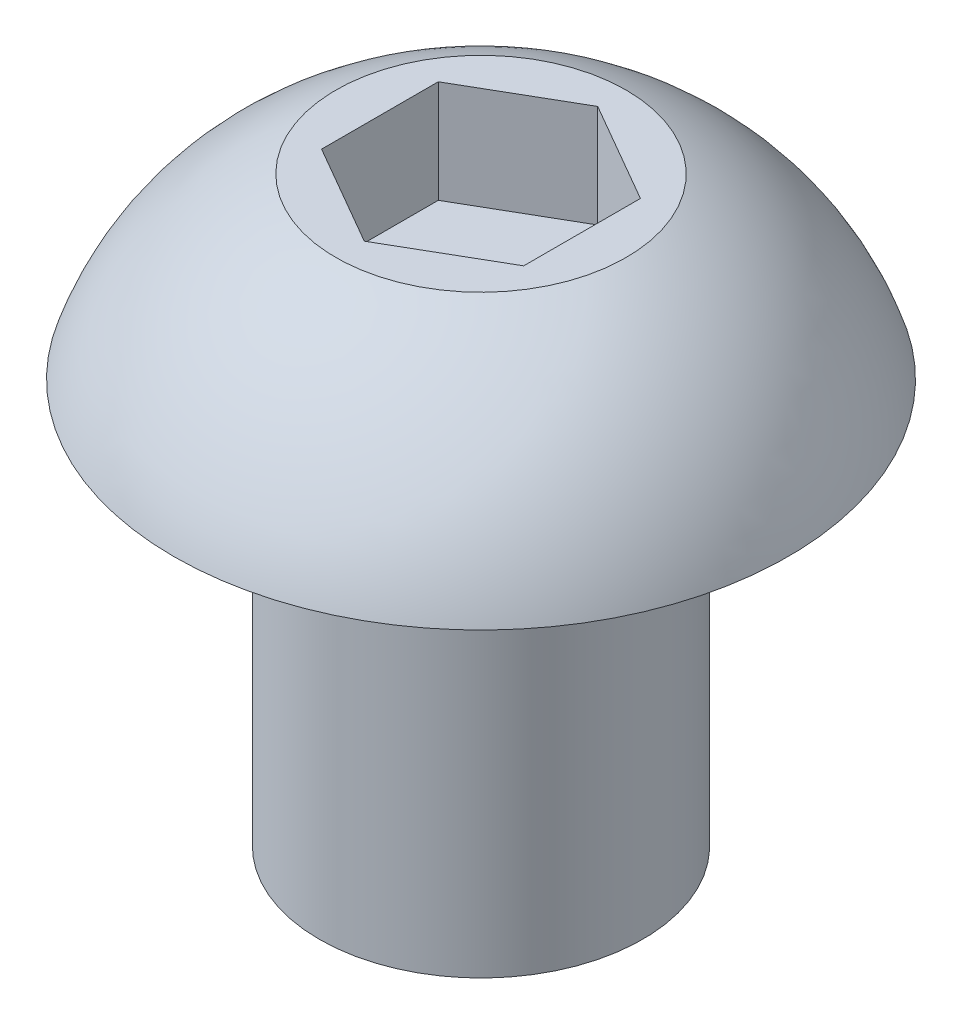
ISO-10303-21;
HEADER;
FILE_DESCRIPTION(('STEP AP214'),'2;1');
FILE_NAME('part.step','',(''),(''),'','','');
FILE_SCHEMA(('AUTOMOTIVE_DESIGN { 1 0 10303 214 1 1 1 1 }'));
ENDSEC;
DATA;
#1=APPLICATION_CONTEXT('core data for automotive mechanical design processes');
#2=APPLICATION_PROTOCOL_DEFINITION('international standard','automotive_design',2000,#1);
#3=PRODUCT_CONTEXT('',#1,'mechanical');
#4=PRODUCT('Part','Part','',(#3));
#5=PRODUCT_RELATED_PRODUCT_CATEGORY('part','',(#4));
#6=PRODUCT_DEFINITION_FORMATION('','',#4);
#7=PRODUCT_DEFINITION_CONTEXT('part definition',#1,'design');
#8=PRODUCT_DEFINITION('design','',#6,#7);
#9=PRODUCT_DEFINITION_SHAPE('','',#8);
#10=(LENGTH_UNIT() NAMED_UNIT(*) SI_UNIT(.MILLI.,.METRE.));
#11=(NAMED_UNIT(*) PLANE_ANGLE_UNIT() SI_UNIT($,.RADIAN.));
#12=(NAMED_UNIT(*) SI_UNIT($,.STERADIAN.) SOLID_ANGLE_UNIT());
#13=UNCERTAINTY_MEASURE_WITH_UNIT(LENGTH_MEASURE(1.E-05),#10,'distance_accuracy_value','');
#14=(GEOMETRIC_REPRESENTATION_CONTEXT(3) GLOBAL_UNCERTAINTY_ASSIGNED_CONTEXT((#13)) GLOBAL_UNIT_ASSIGNED_CONTEXT((#10,
#11,#12)) REPRESENTATION_CONTEXT('',''));
#15=CARTESIAN_POINT('',(0.,0.,0.));
#16=DIRECTION('',(0.,0.,1.));
#17=DIRECTION('',(1.,0.,0.));
#18=AXIS2_PLACEMENT_3D('',#15,#16,#17);
#19=CARTESIAN_POINT('',(0.,-5.,0.));
#20=DIRECTION('',(0.,-1.,0.));
#21=DIRECTION('',(0.,0.,-1.));
#22=AXIS2_PLACEMENT_3D('',#19,#20,#21);
#23=CYLINDRICAL_SURFACE('',#22,2.);
#24=CARTESIAN_POINT('',(0.,-5.,0.));
#25=DIRECTION('',(0.,-1.,0.));
#26=DIRECTION('',(0.,0.,-1.));
#27=AXIS2_PLACEMENT_3D('',#24,#25,#26);
#28=CIRCLE('',#27,2.);
#29=CARTESIAN_POINT('',(0.,-5.,-2.));
#30=VERTEX_POINT('',#29);
#31=EDGE_CURVE('E134',#30,#30,#28,.T.);
#32=ORIENTED_EDGE('',*,*,#31,.F.);
#33=EDGE_LOOP('',(#32));
#34=FACE_BOUND('',#33,.T.);
#35=CARTESIAN_POINT('',(0.,0.,0.));
#36=DIRECTION('',(0.,-1.,0.));
#37=DIRECTION('',(0.,0.,-1.));
#38=AXIS2_PLACEMENT_3D('',#35,#36,#37);
#39=CIRCLE('',#38,2.);
#40=CARTESIAN_POINT('',(0.,0.,-2.));
#41=VERTEX_POINT('',#40);
#42=EDGE_CURVE('E11',#41,#41,#39,.T.);
#43=ORIENTED_EDGE('',*,*,#42,.T.);
#44=EDGE_LOOP('',(#43));
#45=FACE_BOUND('',#44,.T.);
#46=ADVANCED_FACE('F33',(#34,#45),#23,.T.);
#47=CARTESIAN_POINT('',(-2.,0.,0.));
#48=DIRECTION('',(0.,1.,0.));
#49=DIRECTION('',(0.,0.,1.));
#50=AXIS2_PLACEMENT_3D('',#47,#48,#49);
#51=PLANE('',#50);
#52=ORIENTED_EDGE('',*,*,#42,.F.);
#53=EDGE_LOOP('',(#52));
#54=FACE_BOUND('',#53,.T.);
#55=CARTESIAN_POINT('',(0.,0.,0.));
#56=DIRECTION('',(0.,-1.,0.));
#57=DIRECTION('',(0.,0.,-1.));
#58=AXIS2_PLACEMENT_3D('',#55,#56,#57);
#59=CIRCLE('',#58,3.8);
#60=CARTESIAN_POINT('',(0.,0.,-3.8));
#61=VERTEX_POINT('',#60);
#62=EDGE_CURVE('E40',#61,#61,#59,.T.);
#63=ORIENTED_EDGE('',*,*,#62,.T.);
#64=EDGE_LOOP('',(#63));
#65=FACE_BOUND('',#64,.T.);
#66=ADVANCED_FACE('F147',(#54,#65),#51,.F.);
#67=CARTESIAN_POINT('',(0.,-1.07943817047447,0.));
#68=DIRECTION('',(0.,-1.,0.));
#69=DIRECTION('',(0.,0.,-1.));
#70=AXIS2_PLACEMENT_3D('',#67,#68,#69);
#71=DEGENERATE_TOROIDAL_SURFACE('',#70,0.406255794748707,3.5612759643917,.T.);
#72=ORIENTED_EDGE('',*,*,#62,.F.);
#73=EDGE_LOOP('',(#72));
#74=FACE_BOUND('',#73,.T.);
#75=CARTESIAN_POINT('',(0.,2.2,0.));
#76=DIRECTION('',(0.,-1.,0.));
#77=DIRECTION('',(0.,0.,-1.));
#78=AXIS2_PLACEMENT_3D('',#75,#76,#77);
#79=CIRCLE('',#78,1.7947700296736);
#80=CARTESIAN_POINT('',(0.,2.2,-1.7947700296736));
#81=VERTEX_POINT('',#80);
#82=EDGE_CURVE('E142',#81,#81,#79,.T.);
#83=ORIENTED_EDGE('',*,*,#82,.T.);
#84=EDGE_LOOP('',(#83));
#85=FACE_BOUND('',#84,.T.);
#86=ADVANCED_FACE('F149',(#74,#85),#71,.T.);
#87=CARTESIAN_POINT('',(0.,2.2,0.));
#88=DIRECTION('',(0.,-1.,0.));
#89=DIRECTION('',(0.,0.,-1.));
#90=AXIS2_PLACEMENT_3D('',#87,#88,#89);
#91=PLANE('',#90);
#92=DIRECTION('',(0.,0.,1.));
#93=VECTOR('',#92,1.);
#94=CARTESIAN_POINT('',(-1.25,2.2,-0.721687836487032));
#95=LINE('',#94,#93);
#96=CARTESIAN_POINT('',(-1.25,2.2,-0.721687836487032));
#97=VERTEX_POINT('',#96);
#98=CARTESIAN_POINT('',(-1.25,2.2,0.721687836487032));
#99=VERTEX_POINT('',#98);
#100=EDGE_CURVE('E121',#97,#99,#95,.T.);
#101=ORIENTED_EDGE('',*,*,#100,.F.);
#102=DIRECTION('',(-0.866025403784438,0.,0.5));
#103=VECTOR('',#102,1.);
#104=CARTESIAN_POINT('',(0.,2.2,-1.44337567297406));
#105=LINE('',#104,#103);
#106=CARTESIAN_POINT('',(0.,2.2,-1.44337567297406));
#107=VERTEX_POINT('',#106);
#108=EDGE_CURVE('E47',#107,#97,#105,.T.);
#109=ORIENTED_EDGE('',*,*,#108,.F.);
#110=DIRECTION('',(-0.866025403784439,0.,-0.5));
#111=VECTOR('',#110,1.);
#112=CARTESIAN_POINT('',(1.25,2.2,-0.721687836487033));
#113=LINE('',#112,#111);
#114=CARTESIAN_POINT('',(1.25,2.2,-0.721687836487033));
#115=VERTEX_POINT('',#114);
#116=EDGE_CURVE('E130',#115,#107,#113,.T.);
#117=ORIENTED_EDGE('',*,*,#116,.F.);
#118=DIRECTION('',(0.,0.,-1.));
#119=VECTOR('',#118,1.);
#120=CARTESIAN_POINT('',(1.25,2.2,0.721687836487032));
#121=LINE('',#120,#119);
#122=CARTESIAN_POINT('',(1.25,2.2,0.721687836487032));
#123=VERTEX_POINT('',#122);
#124=EDGE_CURVE('E128',#123,#115,#121,.T.);
#125=ORIENTED_EDGE('',*,*,#124,.F.);
#126=DIRECTION('',(0.866025403784438,0.,-0.5));
#127=VECTOR('',#126,1.);
#128=CARTESIAN_POINT('',(0.,2.2,1.44337567297406));
#129=LINE('',#128,#127);
#130=CARTESIAN_POINT('',(0.,2.2,1.44337567297406));
#131=VERTEX_POINT('',#130);
#132=EDGE_CURVE('E95',#131,#123,#129,.T.);
#133=ORIENTED_EDGE('',*,*,#132,.F.);
#134=DIRECTION('',(0.866025403784439,0.,0.5));
#135=VECTOR('',#134,1.);
#136=CARTESIAN_POINT('',(-1.25,2.2,0.721687836487032));
#137=LINE('',#136,#135);
#138=EDGE_CURVE('E124',#99,#131,#137,.T.);
#139=ORIENTED_EDGE('',*,*,#138,.F.);
#140=EDGE_LOOP('',(#101,#109,#117,#125,#133,#139));
#141=FACE_BOUND('',#140,.T.);
#142=ORIENTED_EDGE('',*,*,#82,.F.);
#143=EDGE_LOOP('',(#142));
#144=FACE_BOUND('',#143,.T.);
#145=ADVANCED_FACE('F152',(#141,#144),#91,.F.);
#146=CARTESIAN_POINT('',(-2.,-5.,0.));
#147=DIRECTION('',(0.,1.,0.));
#148=DIRECTION('',(0.,0.,1.));
#149=AXIS2_PLACEMENT_3D('',#146,#147,#148);
#150=PLANE('',#149);
#151=ORIENTED_EDGE('',*,*,#31,.T.);
#152=EDGE_LOOP('',(#151));
#153=FACE_BOUND('',#152,.T.);
#154=ADVANCED_FACE('F157',(#153),#150,.F.);
#155=CARTESIAN_POINT('',(0.,0.93,-1.44337567297406));
#156=DIRECTION('',(-0.5,0.,-0.866025403784439));
#157=DIRECTION('',(-0.866025403784438,0.,0.5));
#158=AXIS2_PLACEMENT_3D('',#155,#156,#157);
#159=PLANE('',#158);
#160=ORIENTED_EDGE('',*,*,#108,.T.);
#161=DIRECTION('',(0.,1.,0.));
#162=VECTOR('',#161,1.);
#163=CARTESIAN_POINT('',(-1.25,0.93,-0.721687836487032));
#164=LINE('',#163,#162);
#165=CARTESIAN_POINT('',(-1.25,0.93,-0.721687836487032));
#166=VERTEX_POINT('',#165);
#167=EDGE_CURVE('E77',#166,#97,#164,.T.);
#168=ORIENTED_EDGE('',*,*,#167,.F.);
#169=DIRECTION('',(-0.866025403784438,0.,0.5));
#170=VECTOR('',#169,1.);
#171=CARTESIAN_POINT('',(0.,0.93,-1.44337567297406));
#172=LINE('',#171,#170);
#173=CARTESIAN_POINT('',(0.,0.93,-1.44337567297406));
#174=VERTEX_POINT('',#173);
#175=EDGE_CURVE('E132',#174,#166,#172,.T.);
#176=ORIENTED_EDGE('',*,*,#175,.F.);
#177=DIRECTION('',(0.,1.,0.));
#178=VECTOR('',#177,1.);
#179=CARTESIAN_POINT('',(0.,0.93,-1.44337567297406));
#180=LINE('',#179,#178);
#181=EDGE_CURVE('E55',#174,#107,#180,.T.);
#182=ORIENTED_EDGE('',*,*,#181,.T.);
#183=EDGE_LOOP('',(#160,#168,#176,#182));
#184=FACE_BOUND('',#183,.T.);
#185=ADVANCED_FACE('F163',(#184),#159,.F.);
#186=CARTESIAN_POINT('',(1.25,0.93,-0.721687836487033));
#187=DIRECTION('',(0.5,0.,-0.866025403784439));
#188=DIRECTION('',(-0.866025403784439,0.,-0.5));
#189=AXIS2_PLACEMENT_3D('',#186,#187,#188);
#190=PLANE('',#189);
#191=ORIENTED_EDGE('',*,*,#116,.T.);
#192=ORIENTED_EDGE('',*,*,#181,.F.);
#193=DIRECTION('',(-0.866025403784439,0.,-0.5));
#194=VECTOR('',#193,1.);
#195=CARTESIAN_POINT('',(1.25,0.93,-0.721687836487033));
#196=LINE('',#195,#194);
#197=CARTESIAN_POINT('',(1.25,0.93,-0.721687836487033));
#198=VERTEX_POINT('',#197);
#199=EDGE_CURVE('E107',#198,#174,#196,.T.);
#200=ORIENTED_EDGE('',*,*,#199,.F.);
#201=DIRECTION('',(0.,1.,0.));
#202=VECTOR('',#201,1.);
#203=CARTESIAN_POINT('',(1.25,0.93,-0.721687836487033));
#204=LINE('',#203,#202);
#205=EDGE_CURVE('E99',#198,#115,#204,.T.);
#206=ORIENTED_EDGE('',*,*,#205,.T.);
#207=EDGE_LOOP('',(#191,#192,#200,#206));
#208=FACE_BOUND('',#207,.T.);
#209=ADVANCED_FACE('F201',(#208),#190,.F.);
#210=CARTESIAN_POINT('',(1.25,0.93,0.721687836487032));
#211=DIRECTION('',(1.,0.,0.));
#212=DIRECTION('',(0.,0.,-1.));
#213=AXIS2_PLACEMENT_3D('',#210,#211,#212);
#214=PLANE('',#213);
#215=ORIENTED_EDGE('',*,*,#124,.T.);
#216=ORIENTED_EDGE('',*,*,#205,.F.);
#217=DIRECTION('',(0.,0.,-1.));
#218=VECTOR('',#217,1.);
#219=CARTESIAN_POINT('',(1.25,0.93,0.721687836487032));
#220=LINE('',#219,#218);
#221=CARTESIAN_POINT('',(1.25,0.93,0.721687836487032));
#222=VERTEX_POINT('',#221);
#223=EDGE_CURVE('E103',#222,#198,#220,.T.);
#224=ORIENTED_EDGE('',*,*,#223,.F.);
#225=DIRECTION('',(0.,1.,0.));
#226=VECTOR('',#225,1.);
#227=CARTESIAN_POINT('',(1.25,0.93,0.721687836487032));
#228=LINE('',#227,#226);
#229=EDGE_CURVE('E88',#222,#123,#228,.T.);
#230=ORIENTED_EDGE('',*,*,#229,.T.);
#231=EDGE_LOOP('',(#215,#216,#224,#230));
#232=FACE_BOUND('',#231,.T.);
#233=ADVANCED_FACE('F104',(#232),#214,.F.);
#234=CARTESIAN_POINT('',(0.,0.93,1.44337567297406));
#235=DIRECTION('',(0.5,0.,0.866025403784438));
#236=DIRECTION('',(0.866025403784439,0.,-0.5));
#237=AXIS2_PLACEMENT_3D('',#234,#235,#236);
#238=PLANE('',#237);
#239=ORIENTED_EDGE('',*,*,#132,.T.);
#240=ORIENTED_EDGE('',*,*,#229,.F.);
#241=DIRECTION('',(0.866025403784438,0.,-0.5));
#242=VECTOR('',#241,1.);
#243=CARTESIAN_POINT('',(0.,0.93,1.44337567297406));
#244=LINE('',#243,#242);
#245=CARTESIAN_POINT('',(0.,0.93,1.44337567297406));
#246=VERTEX_POINT('',#245);
#247=EDGE_CURVE('E92',#246,#222,#244,.T.);
#248=ORIENTED_EDGE('',*,*,#247,.F.);
#249=DIRECTION('',(0.,1.,0.));
#250=VECTOR('',#249,1.);
#251=CARTESIAN_POINT('',(0.,0.93,1.44337567297406));
#252=LINE('',#251,#250);
#253=EDGE_CURVE('E100',#246,#131,#252,.T.);
#254=ORIENTED_EDGE('',*,*,#253,.T.);
#255=EDGE_LOOP('',(#239,#240,#248,#254));
#256=FACE_BOUND('',#255,.T.);
#257=ADVANCED_FACE('F90',(#256),#238,.F.);
#258=CARTESIAN_POINT('',(-1.25,0.93,0.721687836487032));
#259=DIRECTION('',(-0.5,0.,0.866025403784439));
#260=DIRECTION('',(0.866025403784439,0.,0.5));
#261=AXIS2_PLACEMENT_3D('',#258,#259,#260);
#262=PLANE('',#261);
#263=ORIENTED_EDGE('',*,*,#138,.T.);
#264=ORIENTED_EDGE('',*,*,#253,.F.);
#265=DIRECTION('',(0.866025403784439,0.,0.5));
#266=VECTOR('',#265,1.);
#267=CARTESIAN_POINT('',(-1.25,0.93,0.721687836487032));
#268=LINE('',#267,#266);
#269=CARTESIAN_POINT('',(-1.25,0.93,0.721687836487032));
#270=VERTEX_POINT('',#269);
#271=EDGE_CURVE('E113',#270,#246,#268,.T.);
#272=ORIENTED_EDGE('',*,*,#271,.F.);
#273=DIRECTION('',(0.,1.,0.));
#274=VECTOR('',#273,1.);
#275=CARTESIAN_POINT('',(-1.25,0.93,0.721687836487032));
#276=LINE('',#275,#274);
#277=EDGE_CURVE('E137',#270,#99,#276,.T.);
#278=ORIENTED_EDGE('',*,*,#277,.T.);
#279=EDGE_LOOP('',(#263,#264,#272,#278));
#280=FACE_BOUND('',#279,.T.);
#281=ADVANCED_FACE('F226',(#280),#262,.F.);
#282=CARTESIAN_POINT('',(-1.25,0.93,-0.721687836487032));
#283=DIRECTION('',(-1.,0.,0.));
#284=DIRECTION('',(0.,0.,1.));
#285=AXIS2_PLACEMENT_3D('',#282,#283,#284);
#286=PLANE('',#285);
#287=ORIENTED_EDGE('',*,*,#100,.T.);
#288=ORIENTED_EDGE('',*,*,#277,.F.);
#289=DIRECTION('',(0.,0.,1.));
#290=VECTOR('',#289,1.);
#291=CARTESIAN_POINT('',(-1.25,0.93,-0.721687836487032));
#292=LINE('',#291,#290);
#293=EDGE_CURVE('E115',#166,#270,#292,.T.);
#294=ORIENTED_EDGE('',*,*,#293,.F.);
#295=ORIENTED_EDGE('',*,*,#167,.T.);
#296=EDGE_LOOP('',(#287,#288,#294,#295));
#297=FACE_BOUND('',#296,.T.);
#298=ADVANCED_FACE('F235',(#297),#286,.F.);
#299=CARTESIAN_POINT('',(0.,0.93,0.));
#300=DIRECTION('',(0.,1.,0.));
#301=DIRECTION('',(0.,0.,1.));
#302=AXIS2_PLACEMENT_3D('',#299,#300,#301);
#303=PLANE('',#302);
#304=ORIENTED_EDGE('',*,*,#175,.T.);
#305=ORIENTED_EDGE('',*,*,#293,.T.);
#306=ORIENTED_EDGE('',*,*,#271,.T.);
#307=ORIENTED_EDGE('',*,*,#247,.T.);
#308=ORIENTED_EDGE('',*,*,#223,.T.);
#309=ORIENTED_EDGE('',*,*,#199,.T.);
#310=EDGE_LOOP('',(#304,#305,#306,#307,#308,#309));
#311=FACE_BOUND('',#310,.T.);
#312=ADVANCED_FACE('F110',(#311),#303,.T.);
#313=CLOSED_SHELL('',(#46,#66,#86,#145,#154,#185,#209,#233,#257,#281,#298,#312));
#314=MANIFOLD_SOLID_BREP('B2',#313);
#315=ADVANCED_BREP_SHAPE_REPRESENTATION('',(#18,#314),#14);
#316=SHAPE_DEFINITION_REPRESENTATION(#9,#315);
ENDSEC;
END-ISO-10303-21;
